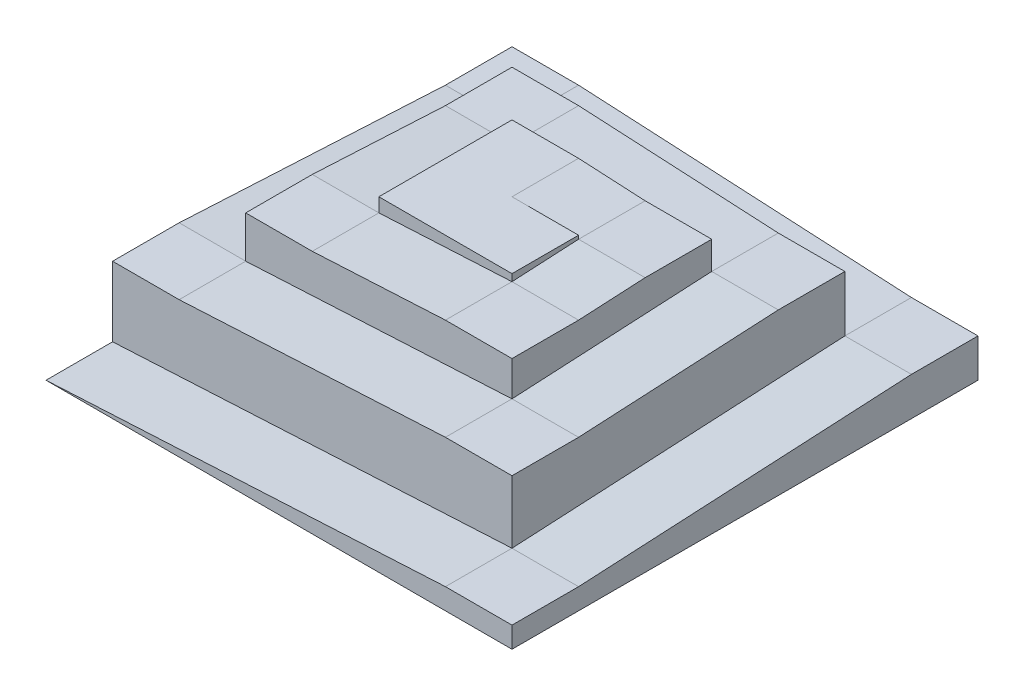
ISO-10303-21;
HEADER;
FILE_DESCRIPTION(('STEP AP214'),'2;1');
FILE_NAME('part.step','',(''),(''),'','','');
FILE_SCHEMA(('AUTOMOTIVE_DESIGN { 1 0 10303 214 1 1 1 1 }'));
ENDSEC;
DATA;
#1=APPLICATION_CONTEXT('core data for automotive mechanical design processes');
#2=APPLICATION_PROTOCOL_DEFINITION('international standard','automotive_design',2000,#1);
#3=PRODUCT_CONTEXT('',#1,'mechanical');
#4=PRODUCT('Part','Part','',(#3));
#5=PRODUCT_RELATED_PRODUCT_CATEGORY('part','',(#4));
#6=PRODUCT_DEFINITION_FORMATION('','',#4);
#7=PRODUCT_DEFINITION_CONTEXT('part definition',#1,'design');
#8=PRODUCT_DEFINITION('design','',#6,#7);
#9=PRODUCT_DEFINITION_SHAPE('','',#8);
#10=(LENGTH_UNIT() NAMED_UNIT(*) SI_UNIT(.MILLI.,.METRE.));
#11=(NAMED_UNIT(*) PLANE_ANGLE_UNIT() SI_UNIT($,.RADIAN.));
#12=(NAMED_UNIT(*) SI_UNIT($,.STERADIAN.) SOLID_ANGLE_UNIT());
#13=UNCERTAINTY_MEASURE_WITH_UNIT(LENGTH_MEASURE(1.E-05),#10,'distance_accuracy_value','');
#14=(GEOMETRIC_REPRESENTATION_CONTEXT(3) GLOBAL_UNCERTAINTY_ASSIGNED_CONTEXT((#13)) GLOBAL_UNIT_ASSIGNED_CONTEXT((#10,
#11,#12)) REPRESENTATION_CONTEXT('',''));
#15=CARTESIAN_POINT('',(0.,0.,0.));
#16=DIRECTION('',(0.,0.,1.));
#17=DIRECTION('',(1.,0.,0.));
#18=AXIS2_PLACEMENT_3D('',#15,#16,#17);
#19=CARTESIAN_POINT('',(133.35,5.99020917205086,19.05));
#20=DIRECTION('',(1.,0.,0.));
#21=DIRECTION('',(0.,0.,-1.));
#22=AXIS2_PLACEMENT_3D('',#19,#20,#21);
#23=PLANE('',#22);
#24=DIRECTION('',(0.,0.,-1.));
#25=VECTOR('',#24,1.);
#26=CARTESIAN_POINT('',(133.35,0.,19.05));
#27=LINE('',#26,#25);
#28=CARTESIAN_POINT('',(133.35,0.,19.05));
#29=VERTEX_POINT('',#28);
#30=CARTESIAN_POINT('',(133.35,0.,-114.3));
#31=VERTEX_POINT('',#30);
#32=EDGE_CURVE('E35',#29,#31,#27,.T.);
#33=ORIENTED_EDGE('',*,*,#32,.T.);
#34=DIRECTION('',(0.,1.,0.));
#35=VECTOR('',#34,1.);
#36=CARTESIAN_POINT('',(133.35,10.9820501487599,-114.3));
#37=LINE('',#36,#35);
#38=CARTESIAN_POINT('',(133.35,10.9820501487599,-114.3));
#39=VERTEX_POINT('',#38);
#40=EDGE_CURVE('E384',#31,#39,#37,.T.);
#41=ORIENTED_EDGE('',*,*,#40,.T.);
#42=DIRECTION('',(0.,0.,1.));
#43=VECTOR('',#42,1.);
#44=CARTESIAN_POINT('',(133.35,10.9820501487599,-95.25));
#45=LINE('',#44,#43);
#46=CARTESIAN_POINT('',(133.35,10.9820501487599,-95.25));
#47=VERTEX_POINT('',#46);
#48=EDGE_CURVE('E398',#39,#47,#45,.T.);
#49=ORIENTED_EDGE('',*,*,#48,.T.);
#50=DIRECTION('',(0.,-0.0523359562429372,0.998629534754574));
#51=VECTOR('',#50,1.);
#52=CARTESIAN_POINT('',(133.35,5.99020917205086,0.));
#53=LINE('',#52,#51);
#54=CARTESIAN_POINT('',(133.35,5.99020917205086,0.));
#55=VERTEX_POINT('',#54);
#56=EDGE_CURVE('E393',#47,#55,#53,.T.);
#57=ORIENTED_EDGE('',*,*,#56,.T.);
#58=DIRECTION('',(0.,0.,-1.));
#59=VECTOR('',#58,1.);
#60=CARTESIAN_POINT('',(133.35,5.99020917205086,19.05));
#61=LINE('',#60,#59);
#62=CARTESIAN_POINT('',(133.35,5.99020917205086,19.05));
#63=VERTEX_POINT('',#62);
#64=EDGE_CURVE('E11',#63,#55,#61,.T.);
#65=ORIENTED_EDGE('',*,*,#64,.F.);
#66=DIRECTION('',(0.,-1.,0.));
#67=VECTOR('',#66,1.);
#68=CARTESIAN_POINT('',(133.35,5.99020917205086,19.05));
#69=LINE('',#68,#67);
#70=EDGE_CURVE('E409',#63,#29,#69,.T.);
#71=ORIENTED_EDGE('',*,*,#70,.T.);
#72=EDGE_LOOP('',(#33,#41,#49,#57,#65,#71));
#73=FACE_BOUND('',#72,.T.);
#74=ADVANCED_FACE('F32',(#73),#23,.T.);
#75=CARTESIAN_POINT('',(114.3,5.99020917205086,19.05));
#76=DIRECTION('',(0.,1.,0.));
#77=DIRECTION('',(-1.,0.,0.));
#78=AXIS2_PLACEMENT_3D('',#75,#76,#77);
#79=PLANE('',#78);
#80=DIRECTION('',(1.,0.,0.));
#81=VECTOR('',#80,1.);
#82=CARTESIAN_POINT('',(114.3,5.99020917205086,0.));
#83=LINE('',#82,#81);
#84=CARTESIAN_POINT('',(114.3,5.99020917205086,0.));
#85=VERTEX_POINT('',#84);
#86=EDGE_CURVE('E412',#85,#55,#83,.T.);
#87=ORIENTED_EDGE('',*,*,#86,.F.);
#88=DIRECTION('',(0.,0.,-1.));
#89=VECTOR('',#88,1.);
#90=CARTESIAN_POINT('',(114.3,5.99020917205086,19.05));
#91=LINE('',#90,#89);
#92=CARTESIAN_POINT('',(114.3,5.99020917205086,19.05));
#93=VERTEX_POINT('',#92);
#94=EDGE_CURVE('E40',#93,#85,#91,.T.);
#95=ORIENTED_EDGE('',*,*,#94,.F.);
#96=DIRECTION('',(1.,0.,0.));
#97=VECTOR('',#96,1.);
#98=CARTESIAN_POINT('',(114.3,5.99020917205086,19.05));
#99=LINE('',#98,#97);
#100=EDGE_CURVE('E417',#93,#63,#99,.T.);
#101=ORIENTED_EDGE('',*,*,#100,.T.);
#102=ORIENTED_EDGE('',*,*,#64,.T.);
#103=EDGE_LOOP('',(#87,#95,#101,#102));
#104=FACE_BOUND('',#103,.T.);
#105=ADVANCED_FACE('F441',(#104),#79,.T.);
#106=CARTESIAN_POINT('',(0.,0.,19.05));
#107=DIRECTION('',(-0.0523359562429373,0.998629534754574,0.));
#108=DIRECTION('',(-0.998629534754574,-0.0523359562429373,0.));
#109=AXIS2_PLACEMENT_3D('',#106,#107,#108);
#110=PLANE('',#109);
#111=DIRECTION('',(0.998629534754574,0.0523359562429373,0.));
#112=VECTOR('',#111,1.);
#113=CARTESIAN_POINT('',(0.,0.,0.));
#114=LINE('',#113,#112);
#115=CARTESIAN_POINT('',(0.,0.,0.));
#116=VERTEX_POINT('',#115);
#117=EDGE_CURVE('E404',#116,#85,#114,.T.);
#118=ORIENTED_EDGE('',*,*,#117,.F.);
#119=DIRECTION('',(0.,0.,-1.));
#120=VECTOR('',#119,1.);
#121=CARTESIAN_POINT('',(0.,0.,19.05));
#122=LINE('',#121,#120);
#123=CARTESIAN_POINT('',(0.,0.,19.05));
#124=VERTEX_POINT('',#123);
#125=EDGE_CURVE('E422',#124,#116,#122,.T.);
#126=ORIENTED_EDGE('',*,*,#125,.F.);
#127=DIRECTION('',(0.998629534754574,0.0523359562429373,0.));
#128=VECTOR('',#127,1.);
#129=CARTESIAN_POINT('',(0.,0.,19.05));
#130=LINE('',#129,#128);
#131=EDGE_CURVE('E415',#124,#93,#130,.T.);
#132=ORIENTED_EDGE('',*,*,#131,.T.);
#133=ORIENTED_EDGE('',*,*,#94,.T.);
#134=EDGE_LOOP('',(#118,#126,#132,#133));
#135=FACE_BOUND('',#134,.T.);
#136=ADVANCED_FACE('F448',(#135),#110,.T.);
#137=CARTESIAN_POINT('',(133.35,0.,19.05));
#138=DIRECTION('',(0.,-1.,0.));
#139=DIRECTION('',(0.,0.,-1.));
#140=AXIS2_PLACEMENT_3D('',#137,#138,#139);
#141=PLANE('',#140);
#142=ORIENTED_EDGE('',*,*,#125,.T.);
#143=DIRECTION('',(0.,0.,-1.));
#144=VECTOR('',#143,1.);
#145=CARTESIAN_POINT('',(0.,0.,-95.25));
#146=LINE('',#145,#144);
#147=CARTESIAN_POINT('',(0.,0.,-114.3));
#148=VERTEX_POINT('',#147);
#149=EDGE_CURVE('E375',#116,#148,#146,.T.);
#150=ORIENTED_EDGE('',*,*,#149,.T.);
#151=DIRECTION('',(1.,0.,0.));
#152=VECTOR('',#151,1.);
#153=CARTESIAN_POINT('',(114.3,0.,-114.3));
#154=LINE('',#153,#152);
#155=EDGE_CURVE('E395',#148,#31,#154,.T.);
#156=ORIENTED_EDGE('',*,*,#155,.T.);
#157=ORIENTED_EDGE('',*,*,#32,.F.);
#158=DIRECTION('',(-1.,0.,0.));
#159=VECTOR('',#158,1.);
#160=CARTESIAN_POINT('',(133.35,0.,19.05));
#161=LINE('',#160,#159);
#162=EDGE_CURVE('E411',#29,#124,#161,.T.);
#163=ORIENTED_EDGE('',*,*,#162,.T.);
#164=EDGE_LOOP('',(#142,#150,#156,#157,#163));
#165=FACE_BOUND('',#164,.T.);
#166=ADVANCED_FACE('F428',(#165),#141,.T.);
#167=CARTESIAN_POINT('',(0.,0.,19.05));
#168=DIRECTION('',(0.,0.,-1.));
#169=DIRECTION('',(-1.,0.,0.));
#170=AXIS2_PLACEMENT_3D('',#167,#168,#169);
#171=PLANE('',#170);
#172=ORIENTED_EDGE('',*,*,#70,.F.);
#173=ORIENTED_EDGE('',*,*,#100,.F.);
#174=ORIENTED_EDGE('',*,*,#131,.F.);
#175=ORIENTED_EDGE('',*,*,#162,.F.);
#176=EDGE_LOOP('',(#172,#173,#174,#175));
#177=FACE_BOUND('',#176,.T.);
#178=ADVANCED_FACE('F445',(#177),#171,.F.);
#179=CARTESIAN_POINT('',(114.3,5.99020917205086,0.));
#180=DIRECTION('',(0.,0.998629534754574,0.0523359562429372));
#181=DIRECTION('',(0.,-0.0523359562429373,0.998629534754574));
#182=AXIS2_PLACEMENT_3D('',#179,#180,#181);
#183=PLANE('',#182);
#184=ORIENTED_EDGE('',*,*,#56,.F.);
#185=DIRECTION('',(1.,0.,0.));
#186=VECTOR('',#185,1.);
#187=CARTESIAN_POINT('',(114.3,10.9820501487599,-95.25));
#188=LINE('',#187,#186);
#189=CARTESIAN_POINT('',(114.3,10.9820501487599,-95.25));
#190=VERTEX_POINT('',#189);
#191=EDGE_CURVE('E402',#190,#47,#188,.T.);
#192=ORIENTED_EDGE('',*,*,#191,.F.);
#193=DIRECTION('',(0.,-0.0523359562429372,0.998629534754574));
#194=VECTOR('',#193,1.);
#195=CARTESIAN_POINT('',(114.3,5.99020917205086,0.));
#196=LINE('',#195,#194);
#197=EDGE_CURVE('E392',#190,#85,#196,.T.);
#198=ORIENTED_EDGE('',*,*,#197,.T.);
#199=ORIENTED_EDGE('',*,*,#86,.T.);
#200=EDGE_LOOP('',(#184,#192,#198,#199));
#201=FACE_BOUND('',#200,.T.);
#202=ADVANCED_FACE('F578',(#201),#183,.T.);
#203=CARTESIAN_POINT('',(114.3,10.9820501487599,-95.25));
#204=DIRECTION('',(0.,1.,0.));
#205=DIRECTION('',(0.,0.,1.));
#206=AXIS2_PLACEMENT_3D('',#203,#204,#205);
#207=PLANE('',#206);
#208=ORIENTED_EDGE('',*,*,#48,.F.);
#209=DIRECTION('',(1.,0.,0.));
#210=VECTOR('',#209,1.);
#211=CARTESIAN_POINT('',(114.3,10.9820501487599,-114.3));
#212=LINE('',#211,#210);
#213=CARTESIAN_POINT('',(114.3,10.9820501487599,-114.3));
#214=VERTEX_POINT('',#213);
#215=EDGE_CURVE('E405',#214,#39,#212,.T.);
#216=ORIENTED_EDGE('',*,*,#215,.F.);
#217=DIRECTION('',(0.,0.,1.));
#218=VECTOR('',#217,1.);
#219=CARTESIAN_POINT('',(114.3,10.9820501487599,-95.25));
#220=LINE('',#219,#218);
#221=EDGE_CURVE('E389',#214,#190,#220,.T.);
#222=ORIENTED_EDGE('',*,*,#221,.T.);
#223=ORIENTED_EDGE('',*,*,#191,.T.);
#224=EDGE_LOOP('',(#208,#216,#222,#223));
#225=FACE_BOUND('',#224,.T.);
#226=ADVANCED_FACE('F437',(#225),#207,.T.);
#227=CARTESIAN_POINT('',(114.3,10.9820501487599,-114.3));
#228=DIRECTION('',(0.,0.,-1.));
#229=DIRECTION('',(-1.,0.,0.));
#230=AXIS2_PLACEMENT_3D('',#227,#228,#229);
#231=PLANE('',#230);
#232=ORIENTED_EDGE('',*,*,#40,.F.);
#233=ORIENTED_EDGE('',*,*,#155,.F.);
#234=DIRECTION('',(0.,1.,0.));
#235=VECTOR('',#234,1.);
#236=CARTESIAN_POINT('',(0.,15.9738911254689,-114.3));
#237=LINE('',#236,#235);
#238=CARTESIAN_POINT('',(0.,15.9738911254689,-114.3));
#239=VERTEX_POINT('',#238);
#240=EDGE_CURVE('E367',#148,#239,#237,.T.);
#241=ORIENTED_EDGE('',*,*,#240,.T.);
#242=DIRECTION('',(1.,0.,0.));
#243=VECTOR('',#242,1.);
#244=CARTESIAN_POINT('',(19.05,15.9738911254689,-114.3));
#245=LINE('',#244,#243);
#246=CARTESIAN_POINT('',(19.05,15.9738911254689,-114.3));
#247=VERTEX_POINT('',#246);
#248=EDGE_CURVE('E378',#239,#247,#245,.T.);
#249=ORIENTED_EDGE('',*,*,#248,.T.);
#250=DIRECTION('',(0.998629534754574,-0.0523359562429373,0.));
#251=VECTOR('',#250,1.);
#252=CARTESIAN_POINT('',(114.3,10.9820501487599,-114.3));
#253=LINE('',#252,#251);
#254=EDGE_CURVE('E373',#247,#214,#253,.T.);
#255=ORIENTED_EDGE('',*,*,#254,.T.);
#256=ORIENTED_EDGE('',*,*,#215,.T.);
#257=EDGE_LOOP('',(#232,#233,#241,#249,#255,#256));
#258=FACE_BOUND('',#257,.T.);
#259=ADVANCED_FACE('F431',(#258),#231,.T.);
#260=CARTESIAN_POINT('',(114.3,10.9820501487599,-95.25));
#261=DIRECTION('',(0.0523359562429373,0.998629534754574,0.));
#262=DIRECTION('',(-0.998629534754574,0.0523359562429373,0.));
#263=AXIS2_PLACEMENT_3D('',#260,#261,#262);
#264=PLANE('',#263);
#265=ORIENTED_EDGE('',*,*,#254,.F.);
#266=DIRECTION('',(0.,0.,-1.));
#267=VECTOR('',#266,1.);
#268=CARTESIAN_POINT('',(19.05,15.9738911254689,-95.25));
#269=LINE('',#268,#267);
#270=CARTESIAN_POINT('',(19.05,15.9738911254689,-95.25));
#271=VERTEX_POINT('',#270);
#272=EDGE_CURVE('E382',#271,#247,#269,.T.);
#273=ORIENTED_EDGE('',*,*,#272,.F.);
#274=DIRECTION('',(0.998629534754574,-0.0523359562429373,0.));
#275=VECTOR('',#274,1.);
#276=CARTESIAN_POINT('',(114.3,10.9820501487599,-95.25));
#277=LINE('',#276,#275);
#278=EDGE_CURVE('E372',#271,#190,#277,.T.);
#279=ORIENTED_EDGE('',*,*,#278,.T.);
#280=ORIENTED_EDGE('',*,*,#221,.F.);
#281=EDGE_LOOP('',(#265,#273,#279,#280));
#282=FACE_BOUND('',#281,.T.);
#283=ADVANCED_FACE('F484',(#282),#264,.T.);
#284=CARTESIAN_POINT('',(19.05,15.9738911254689,-95.25));
#285=DIRECTION('',(0.,1.,0.));
#286=DIRECTION('',(0.,0.,1.));
#287=AXIS2_PLACEMENT_3D('',#284,#285,#286);
#288=PLANE('',#287);
#289=ORIENTED_EDGE('',*,*,#248,.F.);
#290=DIRECTION('',(0.,0.,-1.));
#291=VECTOR('',#290,1.);
#292=CARTESIAN_POINT('',(0.,15.9738911254689,-95.25));
#293=LINE('',#292,#291);
#294=CARTESIAN_POINT('',(0.,15.9738911254689,-95.25));
#295=VERTEX_POINT('',#294);
#296=EDGE_CURVE('E385',#295,#239,#293,.T.);
#297=ORIENTED_EDGE('',*,*,#296,.F.);
#298=DIRECTION('',(1.,0.,0.));
#299=VECTOR('',#298,1.);
#300=CARTESIAN_POINT('',(19.05,15.9738911254689,-95.25));
#301=LINE('',#300,#299);
#302=EDGE_CURVE('E369',#295,#271,#301,.T.);
#303=ORIENTED_EDGE('',*,*,#302,.T.);
#304=ORIENTED_EDGE('',*,*,#272,.T.);
#305=EDGE_LOOP('',(#289,#297,#303,#304));
#306=FACE_BOUND('',#305,.T.);
#307=ADVANCED_FACE('F480',(#306),#288,.T.);
#308=CARTESIAN_POINT('',(0.,15.9738911254689,-95.25));
#309=DIRECTION('',(-1.,0.,0.));
#310=DIRECTION('',(0.,0.,1.));
#311=AXIS2_PLACEMENT_3D('',#308,#309,#310);
#312=PLANE('',#311);
#313=ORIENTED_EDGE('',*,*,#240,.F.);
#314=ORIENTED_EDGE('',*,*,#149,.F.);
#315=DIRECTION('',(0.,1.,0.));
#316=VECTOR('',#315,1.);
#317=CARTESIAN_POINT('',(0.,19.9673639068361,0.));
#318=LINE('',#317,#316);
#319=CARTESIAN_POINT('',(0.,19.9673639068361,0.));
#320=VERTEX_POINT('',#319);
#321=EDGE_CURVE('E350',#116,#320,#318,.T.);
#322=ORIENTED_EDGE('',*,*,#321,.T.);
#323=DIRECTION('',(0.,0.,-1.));
#324=VECTOR('',#323,1.);
#325=CARTESIAN_POINT('',(0.,19.9673639068361,-19.05));
#326=LINE('',#325,#324);
#327=CARTESIAN_POINT('',(0.,19.9673639068361,-19.05));
#328=VERTEX_POINT('',#327);
#329=EDGE_CURVE('E361',#320,#328,#326,.T.);
#330=ORIENTED_EDGE('',*,*,#329,.T.);
#331=DIRECTION('',(0.,-0.0523359562429358,-0.998629534754574));
#332=VECTOR('',#331,1.);
#333=CARTESIAN_POINT('',(0.,15.9738911254689,-95.25));
#334=LINE('',#333,#332);
#335=EDGE_CURVE('E356',#328,#295,#334,.T.);
#336=ORIENTED_EDGE('',*,*,#335,.T.);
#337=ORIENTED_EDGE('',*,*,#296,.T.);
#338=EDGE_LOOP('',(#313,#314,#322,#330,#336,#337));
#339=FACE_BOUND('',#338,.T.);
#340=ADVANCED_FACE('F476',(#339),#312,.T.);
#341=CARTESIAN_POINT('',(19.05,15.9738911254689,-95.25));
#342=DIRECTION('',(0.,0.998629534754574,-0.0523359562429358));
#343=DIRECTION('',(0.,0.0523359562429358,0.998629534754574));
#344=AXIS2_PLACEMENT_3D('',#341,#342,#343);
#345=PLANE('',#344);
#346=ORIENTED_EDGE('',*,*,#335,.F.);
#347=DIRECTION('',(-1.,0.,0.));
#348=VECTOR('',#347,1.);
#349=CARTESIAN_POINT('',(19.05,19.9673639068361,-19.05));
#350=LINE('',#349,#348);
#351=CARTESIAN_POINT('',(19.05,19.9673639068361,-19.05));
#352=VERTEX_POINT('',#351);
#353=EDGE_CURVE('E365',#352,#328,#350,.T.);
#354=ORIENTED_EDGE('',*,*,#353,.F.);
#355=DIRECTION('',(0.,-0.0523359562429358,-0.998629534754574));
#356=VECTOR('',#355,1.);
#357=CARTESIAN_POINT('',(19.05,15.9738911254689,-95.25));
#358=LINE('',#357,#356);
#359=EDGE_CURVE('E355',#352,#271,#358,.T.);
#360=ORIENTED_EDGE('',*,*,#359,.T.);
#361=ORIENTED_EDGE('',*,*,#302,.F.);
#362=EDGE_LOOP('',(#346,#354,#360,#361));
#363=FACE_BOUND('',#362,.T.);
#364=ADVANCED_FACE('F602',(#363),#345,.T.);
#365=CARTESIAN_POINT('',(19.05,19.9673639068361,-19.05));
#366=DIRECTION('',(0.,1.,0.));
#367=DIRECTION('',(0.,0.,1.));
#368=AXIS2_PLACEMENT_3D('',#365,#366,#367);
#369=PLANE('',#368);
#370=ORIENTED_EDGE('',*,*,#329,.F.);
#371=DIRECTION('',(-1.,0.,0.));
#372=VECTOR('',#371,1.);
#373=CARTESIAN_POINT('',(19.05,19.9673639068361,0.));
#374=LINE('',#373,#372);
#375=CARTESIAN_POINT('',(19.05,19.9673639068361,0.));
#376=VERTEX_POINT('',#375);
#377=EDGE_CURVE('E358',#376,#320,#374,.T.);
#378=ORIENTED_EDGE('',*,*,#377,.F.);
#379=DIRECTION('',(0.,0.,-1.));
#380=VECTOR('',#379,1.);
#381=CARTESIAN_POINT('',(19.05,19.9673639068361,-19.05));
#382=LINE('',#381,#380);
#383=EDGE_CURVE('E352',#376,#352,#382,.T.);
#384=ORIENTED_EDGE('',*,*,#383,.T.);
#385=ORIENTED_EDGE('',*,*,#353,.T.);
#386=EDGE_LOOP('',(#370,#378,#384,#385));
#387=FACE_BOUND('',#386,.T.);
#388=ADVANCED_FACE('F472',(#387),#369,.T.);
#389=CARTESIAN_POINT('',(19.05,19.9673639068361,0.));
#390=DIRECTION('',(0.,0.,1.));
#391=DIRECTION('',(1.,0.,0.));
#392=AXIS2_PLACEMENT_3D('',#389,#390,#391);
#393=PLANE('',#392);
#394=ORIENTED_EDGE('',*,*,#321,.F.);
#395=ORIENTED_EDGE('',*,*,#117,.T.);
#396=DIRECTION('',(0.,1.,0.));
#397=VECTOR('',#396,1.);
#398=CARTESIAN_POINT('',(114.3,0.,0.));
#399=LINE('',#398,#397);
#400=CARTESIAN_POINT('',(114.3,23.9608366882033,0.));
#401=VERTEX_POINT('',#400);
#402=EDGE_CURVE('E339',#85,#401,#399,.T.);
#403=ORIENTED_EDGE('',*,*,#402,.T.);
#404=DIRECTION('',(-1.,0.,0.));
#405=VECTOR('',#404,1.);
#406=CARTESIAN_POINT('',(114.3,23.9608366882033,0.));
#407=LINE('',#406,#405);
#408=CARTESIAN_POINT('',(95.25,23.9608366882033,0.));
#409=VERTEX_POINT('',#408);
#410=EDGE_CURVE('E332',#401,#409,#407,.T.);
#411=ORIENTED_EDGE('',*,*,#410,.T.);
#412=DIRECTION('',(-0.998629534754574,-0.0523359562429372,0.));
#413=VECTOR('',#412,1.);
#414=CARTESIAN_POINT('',(95.25,23.9608366882033,0.));
#415=LINE('',#414,#413);
#416=EDGE_CURVE('E344',#409,#376,#415,.T.);
#417=ORIENTED_EDGE('',*,*,#416,.T.);
#418=ORIENTED_EDGE('',*,*,#377,.T.);
#419=EDGE_LOOP('',(#394,#395,#403,#411,#417,#418));
#420=FACE_BOUND('',#419,.T.);
#421=ADVANCED_FACE('F451',(#420),#393,.T.);
#422=CARTESIAN_POINT('',(114.3,23.9608366882033,-19.05));
#423=DIRECTION('',(0.,1.,0.));
#424=DIRECTION('',(-1.,0.,0.));
#425=AXIS2_PLACEMENT_3D('',#422,#423,#424);
#426=PLANE('',#425);
#427=ORIENTED_EDGE('',*,*,#410,.F.);
#428=DIRECTION('',(0.,0.,1.));
#429=VECTOR('',#428,1.);
#430=CARTESIAN_POINT('',(114.3,23.9608366882033,-19.05));
#431=LINE('',#430,#429);
#432=CARTESIAN_POINT('',(114.3,23.9608366882033,-19.05));
#433=VERTEX_POINT('',#432);
#434=EDGE_CURVE('E347',#433,#401,#431,.T.);
#435=ORIENTED_EDGE('',*,*,#434,.F.);
#436=DIRECTION('',(-1.,0.,0.));
#437=VECTOR('',#436,1.);
#438=CARTESIAN_POINT('',(114.3,23.9608366882033,-19.05));
#439=LINE('',#438,#437);
#440=CARTESIAN_POINT('',(95.25,23.9608366882034,-19.05));
#441=VERTEX_POINT('',#440);
#442=EDGE_CURVE('E335',#433,#441,#439,.T.);
#443=ORIENTED_EDGE('',*,*,#442,.T.);
#444=DIRECTION('',(0.,0.,1.));
#445=VECTOR('',#444,1.);
#446=CARTESIAN_POINT('',(95.25,23.9608366882033,-19.05));
#447=LINE('',#446,#445);
#448=EDGE_CURVE('E341',#441,#409,#447,.T.);
#449=ORIENTED_EDGE('',*,*,#448,.T.);
#450=EDGE_LOOP('',(#427,#435,#443,#449));
#451=FACE_BOUND('',#450,.T.);
#452=ADVANCED_FACE('F461',(#451),#426,.T.);
#453=CARTESIAN_POINT('',(114.3,0.,-19.05));
#454=DIRECTION('',(1.,0.,0.));
#455=DIRECTION('',(0.,0.,-1.));
#456=AXIS2_PLACEMENT_3D('',#453,#454,#455);
#457=PLANE('',#456);
#458=ORIENTED_EDGE('',*,*,#402,.F.);
#459=ORIENTED_EDGE('',*,*,#197,.F.);
#460=DIRECTION('',(0.,1.,0.));
#461=VECTOR('',#460,1.);
#462=CARTESIAN_POINT('',(114.3,26.9559412742289,-95.25));
#463=LINE('',#462,#461);
#464=CARTESIAN_POINT('',(114.3,26.9559412742289,-95.25));
#465=VERTEX_POINT('',#464);
#466=EDGE_CURVE('E315',#190,#465,#463,.T.);
#467=ORIENTED_EDGE('',*,*,#466,.T.);
#468=DIRECTION('',(0.,0.,1.));
#469=VECTOR('',#468,1.);
#470=CARTESIAN_POINT('',(114.3,26.9559412742289,-76.2));
#471=LINE('',#470,#469);
#472=CARTESIAN_POINT('',(114.3,26.9559412742289,-76.2));
#473=VERTEX_POINT('',#472);
#474=EDGE_CURVE('E326',#465,#473,#471,.T.);
#475=ORIENTED_EDGE('',*,*,#474,.T.);
#476=DIRECTION('',(0.,-0.0523359562429375,0.998629534754574));
#477=VECTOR('',#476,1.);
#478=CARTESIAN_POINT('',(114.3,23.9608366882034,-19.05));
#479=LINE('',#478,#477);
#480=EDGE_CURVE('E322',#473,#433,#479,.T.);
#481=ORIENTED_EDGE('',*,*,#480,.T.);
#482=ORIENTED_EDGE('',*,*,#434,.T.);
#483=EDGE_LOOP('',(#458,#459,#467,#475,#481,#482));
#484=FACE_BOUND('',#483,.T.);
#485=ADVANCED_FACE('F454',(#484),#457,.T.);
#486=CARTESIAN_POINT('',(95.25,23.9608366882033,-19.05));
#487=DIRECTION('',(-0.0523359562429371,0.998629534754574,0.));
#488=DIRECTION('',(-0.998629534754574,-0.0523359562429372,0.));
#489=AXIS2_PLACEMENT_3D('',#486,#487,#488);
#490=PLANE('',#489);
#491=ORIENTED_EDGE('',*,*,#416,.F.);
#492=ORIENTED_EDGE('',*,*,#448,.F.);
#493=DIRECTION('',(-0.998629534754574,-0.0523359562429372,0.));
#494=VECTOR('',#493,1.);
#495=CARTESIAN_POINT('',(95.25,23.9608366882033,-19.05));
#496=LINE('',#495,#494);
#497=EDGE_CURVE('E338',#441,#352,#496,.T.);
#498=ORIENTED_EDGE('',*,*,#497,.T.);
#499=ORIENTED_EDGE('',*,*,#383,.F.);
#500=EDGE_LOOP('',(#491,#492,#498,#499));
#501=FACE_BOUND('',#500,.T.);
#502=ADVANCED_FACE('F468',(#501),#490,.T.);
#503=CARTESIAN_POINT('',(95.25,23.9608366882034,-19.05));
#504=DIRECTION('',(0.,0.998629534754574,0.0523359562429375));
#505=DIRECTION('',(0.,-0.0523359562429375,0.998629534754574));
#506=AXIS2_PLACEMENT_3D('',#503,#504,#505);
#507=PLANE('',#506);
#508=ORIENTED_EDGE('',*,*,#480,.F.);
#509=DIRECTION('',(1.,0.,0.));
#510=VECTOR('',#509,1.);
#511=CARTESIAN_POINT('',(95.25,26.9559412742289,-76.2));
#512=LINE('',#511,#510);
#513=CARTESIAN_POINT('',(95.25,26.9559412742289,-76.2));
#514=VERTEX_POINT('',#513);
#515=EDGE_CURVE('E330',#514,#473,#512,.T.);
#516=ORIENTED_EDGE('',*,*,#515,.F.);
#517=DIRECTION('',(0.,-0.0523359562429375,0.998629534754574));
#518=VECTOR('',#517,1.);
#519=CARTESIAN_POINT('',(95.25,23.9608366882034,-19.05));
#520=LINE('',#519,#518);
#521=EDGE_CURVE('E321',#514,#441,#520,.T.);
#522=ORIENTED_EDGE('',*,*,#521,.T.);
#523=ORIENTED_EDGE('',*,*,#442,.F.);
#524=EDGE_LOOP('',(#508,#516,#522,#523));
#525=FACE_BOUND('',#524,.T.);
#526=ADVANCED_FACE('F510',(#525),#507,.T.);
#527=CARTESIAN_POINT('',(95.25,26.9559412742289,-76.2));
#528=DIRECTION('',(0.,1.,0.));
#529=DIRECTION('',(0.,0.,1.));
#530=AXIS2_PLACEMENT_3D('',#527,#528,#529);
#531=PLANE('',#530);
#532=ORIENTED_EDGE('',*,*,#474,.F.);
#533=DIRECTION('',(1.,0.,0.));
#534=VECTOR('',#533,1.);
#535=CARTESIAN_POINT('',(95.25,26.9559412742289,-95.25));
#536=LINE('',#535,#534);
#537=CARTESIAN_POINT('',(95.25,26.9559412742289,-95.25));
#538=VERTEX_POINT('',#537);
#539=EDGE_CURVE('E324',#538,#465,#536,.T.);
#540=ORIENTED_EDGE('',*,*,#539,.F.);
#541=DIRECTION('',(0.,0.,1.));
#542=VECTOR('',#541,1.);
#543=CARTESIAN_POINT('',(95.25,26.9559412742289,-76.2));
#544=LINE('',#543,#542);
#545=EDGE_CURVE('E318',#538,#514,#544,.T.);
#546=ORIENTED_EDGE('',*,*,#545,.T.);
#547=ORIENTED_EDGE('',*,*,#515,.T.);
#548=EDGE_LOOP('',(#532,#540,#546,#547));
#549=FACE_BOUND('',#548,.T.);
#550=ADVANCED_FACE('F507',(#549),#531,.T.);
#551=CARTESIAN_POINT('',(95.25,26.9559412742289,-95.25));
#552=DIRECTION('',(0.,0.,-1.));
#553=DIRECTION('',(-1.,0.,0.));
#554=AXIS2_PLACEMENT_3D('',#551,#552,#553);
#555=PLANE('',#554);
#556=ORIENTED_EDGE('',*,*,#466,.F.);
#557=ORIENTED_EDGE('',*,*,#278,.F.);
#558=DIRECTION('',(0.,1.,0.));
#559=VECTOR('',#558,1.);
#560=CARTESIAN_POINT('',(19.05,29.9510458602543,-95.25));
#561=LINE('',#560,#559);
#562=CARTESIAN_POINT('',(19.05,29.9510458602543,-95.25));
#563=VERTEX_POINT('',#562);
#564=EDGE_CURVE('E300',#271,#563,#561,.T.);
#565=ORIENTED_EDGE('',*,*,#564,.T.);
#566=DIRECTION('',(1.,0.,0.));
#567=VECTOR('',#566,1.);
#568=CARTESIAN_POINT('',(38.1,29.9510458602543,-95.25));
#569=LINE('',#568,#567);
#570=CARTESIAN_POINT('',(38.1,29.9510458602543,-95.25));
#571=VERTEX_POINT('',#570);
#572=EDGE_CURVE('E309',#563,#571,#569,.T.);
#573=ORIENTED_EDGE('',*,*,#572,.T.);
#574=DIRECTION('',(0.998629534754574,-0.0523359562429373,0.));
#575=VECTOR('',#574,1.);
#576=CARTESIAN_POINT('',(95.25,26.9559412742289,-95.25));
#577=LINE('',#576,#575);
#578=EDGE_CURVE('E305',#571,#538,#577,.T.);
#579=ORIENTED_EDGE('',*,*,#578,.T.);
#580=ORIENTED_EDGE('',*,*,#539,.T.);
#581=EDGE_LOOP('',(#556,#557,#565,#573,#579,#580));
#582=FACE_BOUND('',#581,.T.);
#583=ADVANCED_FACE('F488',(#582),#555,.T.);
#584=CARTESIAN_POINT('',(95.25,26.9559412742289,-76.2));
#585=DIRECTION('',(0.0523359562429373,0.998629534754574,0.));
#586=DIRECTION('',(-0.998629534754574,0.0523359562429373,0.));
#587=AXIS2_PLACEMENT_3D('',#584,#585,#586);
#588=PLANE('',#587);
#589=ORIENTED_EDGE('',*,*,#578,.F.);
#590=DIRECTION('',(0.,0.,-1.));
#591=VECTOR('',#590,1.);
#592=CARTESIAN_POINT('',(38.1,29.9510458602543,-76.2));
#593=LINE('',#592,#591);
#594=CARTESIAN_POINT('',(38.1,29.9510458602543,-76.2));
#595=VERTEX_POINT('',#594);
#596=EDGE_CURVE('E313',#595,#571,#593,.T.);
#597=ORIENTED_EDGE('',*,*,#596,.F.);
#598=DIRECTION('',(0.998629534754574,-0.0523359562429373,0.));
#599=VECTOR('',#598,1.);
#600=CARTESIAN_POINT('',(95.25,26.9559412742289,-76.2));
#601=LINE('',#600,#599);
#602=EDGE_CURVE('E304',#595,#514,#601,.T.);
#603=ORIENTED_EDGE('',*,*,#602,.T.);
#604=ORIENTED_EDGE('',*,*,#545,.F.);
#605=EDGE_LOOP('',(#589,#597,#603,#604));
#606=FACE_BOUND('',#605,.T.);
#607=ADVANCED_FACE('F502',(#606),#588,.T.);
#608=CARTESIAN_POINT('',(38.1,29.9510458602543,-76.2));
#609=DIRECTION('',(0.,1.,0.));
#610=DIRECTION('',(-1.,0.,0.));
#611=AXIS2_PLACEMENT_3D('',#608,#609,#610);
#612=PLANE('',#611);
#613=ORIENTED_EDGE('',*,*,#572,.F.);
#614=DIRECTION('',(0.,0.,-1.));
#615=VECTOR('',#614,1.);
#616=CARTESIAN_POINT('',(19.05,29.9510458602543,-76.2));
#617=LINE('',#616,#615);
#618=CARTESIAN_POINT('',(19.05,29.9510458602543,-76.2));
#619=VERTEX_POINT('',#618);
#620=EDGE_CURVE('E307',#619,#563,#617,.T.);
#621=ORIENTED_EDGE('',*,*,#620,.F.);
#622=DIRECTION('',(1.,0.,0.));
#623=VECTOR('',#622,1.);
#624=CARTESIAN_POINT('',(38.1,29.9510458602543,-76.2));
#625=LINE('',#624,#623);
#626=EDGE_CURVE('E301',#619,#595,#625,.T.);
#627=ORIENTED_EDGE('',*,*,#626,.T.);
#628=ORIENTED_EDGE('',*,*,#596,.T.);
#629=EDGE_LOOP('',(#613,#621,#627,#628));
#630=FACE_BOUND('',#629,.T.);
#631=ADVANCED_FACE('F497',(#630),#612,.T.);
#632=CARTESIAN_POINT('',(19.05,29.9510458602543,-76.2));
#633=DIRECTION('',(-1.,0.,0.));
#634=DIRECTION('',(0.,0.,1.));
#635=AXIS2_PLACEMENT_3D('',#632,#633,#634);
#636=PLANE('',#635);
#637=ORIENTED_EDGE('',*,*,#564,.F.);
#638=ORIENTED_EDGE('',*,*,#359,.F.);
#639=DIRECTION('',(0.,-1.,0.));
#640=VECTOR('',#639,1.);
#641=CARTESIAN_POINT('',(19.05,31.9477822509381,-19.05));
#642=LINE('',#641,#640);
#643=CARTESIAN_POINT('',(19.05,31.9477822509381,-19.05));
#644=VERTEX_POINT('',#643);
#645=EDGE_CURVE('E280',#644,#352,#642,.T.);
#646=ORIENTED_EDGE('',*,*,#645,.F.);
#647=DIRECTION('',(0.,0.,1.));
#648=VECTOR('',#647,1.);
#649=CARTESIAN_POINT('',(19.05,31.9477822509381,-38.1));
#650=LINE('',#649,#648);
#651=CARTESIAN_POINT('',(19.05,31.9477822509381,-38.1));
#652=VERTEX_POINT('',#651);
#653=EDGE_CURVE('E286',#652,#644,#650,.T.);
#654=ORIENTED_EDGE('',*,*,#653,.F.);
#655=DIRECTION('',(0.,0.0523359562429419,0.998629534754574));
#656=VECTOR('',#655,1.);
#657=CARTESIAN_POINT('',(19.05,29.9510458602543,-76.2));
#658=LINE('',#657,#656);
#659=EDGE_CURVE('E292',#619,#652,#658,.T.);
#660=ORIENTED_EDGE('',*,*,#659,.F.);
#661=ORIENTED_EDGE('',*,*,#620,.T.);
#662=EDGE_LOOP('',(#637,#638,#646,#654,#660,#661));
#663=FACE_BOUND('',#662,.T.);
#664=ADVANCED_FACE('F490',(#663),#636,.T.);
#665=CARTESIAN_POINT('',(38.1,31.9477822509381,-19.05));
#666=DIRECTION('',(0.,0.,-1.));
#667=DIRECTION('',(0.,1.,0.));
#668=AXIS2_PLACEMENT_3D('',#665,#666,#667);
#669=PLANE('',#668);
#670=ORIENTED_EDGE('',*,*,#645,.T.);
#671=ORIENTED_EDGE('',*,*,#497,.F.);
#672=DIRECTION('',(0.,1.,0.));
#673=VECTOR('',#672,1.);
#674=CARTESIAN_POINT('',(95.25,33.9445186416217,-19.05));
#675=LINE('',#674,#673);
#676=CARTESIAN_POINT('',(95.25,33.9445186416217,-19.05));
#677=VERTEX_POINT('',#676);
#678=EDGE_CURVE('E263',#441,#677,#675,.T.);
#679=ORIENTED_EDGE('',*,*,#678,.T.);
#680=DIRECTION('',(-1.,0.,0.));
#681=VECTOR('',#680,1.);
#682=CARTESIAN_POINT('',(76.2,33.9445186416217,-19.05));
#683=LINE('',#682,#681);
#684=CARTESIAN_POINT('',(76.2,33.9445186416217,-19.05));
#685=VERTEX_POINT('',#684);
#686=EDGE_CURVE('E273',#677,#685,#683,.T.);
#687=ORIENTED_EDGE('',*,*,#686,.T.);
#688=DIRECTION('',(-0.998629534754574,-0.0523359562429372,0.));
#689=VECTOR('',#688,1.);
#690=CARTESIAN_POINT('',(38.1,31.9477822509381,-19.05));
#691=LINE('',#690,#689);
#692=CARTESIAN_POINT('',(38.1,31.9477822509381,-19.05));
#693=VERTEX_POINT('',#692);
#694=EDGE_CURVE('E269',#685,#693,#691,.T.);
#695=ORIENTED_EDGE('',*,*,#694,.T.);
#696=DIRECTION('',(-1.,0.,0.));
#697=VECTOR('',#696,1.);
#698=CARTESIAN_POINT('',(38.1,31.9477822509381,-19.05));
#699=LINE('',#698,#697);
#700=EDGE_CURVE('E289',#693,#644,#699,.T.);
#701=ORIENTED_EDGE('',*,*,#700,.T.);
#702=EDGE_LOOP('',(#670,#671,#679,#687,#695,#701));
#703=FACE_BOUND('',#702,.T.);
#704=ADVANCED_FACE('F513',(#703),#669,.F.);
#705=CARTESIAN_POINT('',(38.1,29.9510458602543,-76.2));
#706=DIRECTION('',(0.,-0.998629534754574,0.0523359562429419));
#707=DIRECTION('',(0.,-0.0523359562429419,-0.998629534754574));
#708=AXIS2_PLACEMENT_3D('',#705,#706,#707);
#709=PLANE('',#708);
#710=ORIENTED_EDGE('',*,*,#659,.T.);
#711=DIRECTION('',(-1.,0.,0.));
#712=VECTOR('',#711,1.);
#713=CARTESIAN_POINT('',(38.1,31.9477822509381,-38.1));
#714=LINE('',#713,#712);
#715=CARTESIAN_POINT('',(38.1,31.9477822509381,-38.1));
#716=VERTEX_POINT('',#715);
#717=EDGE_CURVE('E297',#716,#652,#714,.T.);
#718=ORIENTED_EDGE('',*,*,#717,.F.);
#719=DIRECTION('',(0.,0.0523359562429419,0.998629534754574));
#720=VECTOR('',#719,1.);
#721=CARTESIAN_POINT('',(38.1,29.9510458602543,-76.2));
#722=LINE('',#721,#720);
#723=EDGE_CURVE('E283',#595,#716,#722,.T.);
#724=ORIENTED_EDGE('',*,*,#723,.F.);
#725=ORIENTED_EDGE('',*,*,#626,.F.);
#726=EDGE_LOOP('',(#710,#718,#724,#725));
#727=FACE_BOUND('',#726,.T.);
#728=ADVANCED_FACE('F533',(#727),#709,.F.);
#729=CARTESIAN_POINT('',(38.1,31.9477822509381,-38.1));
#730=DIRECTION('',(0.,-1.,0.));
#731=DIRECTION('',(0.,0.,-1.));
#732=AXIS2_PLACEMENT_3D('',#729,#730,#731);
#733=PLANE('',#732);
#734=ORIENTED_EDGE('',*,*,#653,.T.);
#735=ORIENTED_EDGE('',*,*,#700,.F.);
#736=DIRECTION('',(0.,0.,1.));
#737=VECTOR('',#736,1.);
#738=CARTESIAN_POINT('',(38.1,31.9477822509381,-38.1));
#739=LINE('',#738,#737);
#740=EDGE_CURVE('E285',#716,#693,#739,.T.);
#741=ORIENTED_EDGE('',*,*,#740,.F.);
#742=ORIENTED_EDGE('',*,*,#717,.T.);
#743=EDGE_LOOP('',(#734,#735,#741,#742));
#744=FACE_BOUND('',#743,.T.);
#745=ADVANCED_FACE('F529',(#744),#733,.F.);
#746=CARTESIAN_POINT('',(38.1,31.9477822509381,-38.1));
#747=DIRECTION('',(-0.0523359562429372,0.998629534754574,0.));
#748=DIRECTION('',(-0.998629534754574,-0.0523359562429372,0.));
#749=AXIS2_PLACEMENT_3D('',#746,#747,#748);
#750=PLANE('',#749);
#751=ORIENTED_EDGE('',*,*,#694,.F.);
#752=DIRECTION('',(0.,0.,1.));
#753=VECTOR('',#752,1.);
#754=CARTESIAN_POINT('',(76.2,33.9445186416217,-38.1));
#755=LINE('',#754,#753);
#756=CARTESIAN_POINT('',(76.2,33.9445186416217,-38.1));
#757=VERTEX_POINT('',#756);
#758=EDGE_CURVE('E278',#757,#685,#755,.T.);
#759=ORIENTED_EDGE('',*,*,#758,.F.);
#760=DIRECTION('',(-0.998629534754574,-0.0523359562429372,0.));
#761=VECTOR('',#760,1.);
#762=CARTESIAN_POINT('',(38.1,31.9477822509381,-38.1));
#763=LINE('',#762,#761);
#764=EDGE_CURVE('E212',#757,#716,#763,.T.);
#765=ORIENTED_EDGE('',*,*,#764,.T.);
#766=ORIENTED_EDGE('',*,*,#740,.T.);
#767=EDGE_LOOP('',(#751,#759,#765,#766));
#768=FACE_BOUND('',#767,.T.);
#769=ADVANCED_FACE('F526',(#768),#750,.T.);
#770=CARTESIAN_POINT('',(76.2,33.9445186416217,-38.1));
#771=DIRECTION('',(0.,1.,0.));
#772=DIRECTION('',(0.,0.,1.));
#773=AXIS2_PLACEMENT_3D('',#770,#771,#772);
#774=PLANE('',#773);
#775=ORIENTED_EDGE('',*,*,#686,.F.);
#776=DIRECTION('',(0.,0.,1.));
#777=VECTOR('',#776,1.);
#778=CARTESIAN_POINT('',(95.25,33.9445186416217,-38.1));
#779=LINE('',#778,#777);
#780=CARTESIAN_POINT('',(95.25,33.9445186416217,-38.1));
#781=VERTEX_POINT('',#780);
#782=EDGE_CURVE('E271',#781,#677,#779,.T.);
#783=ORIENTED_EDGE('',*,*,#782,.F.);
#784=DIRECTION('',(-1.,0.,0.));
#785=VECTOR('',#784,1.);
#786=CARTESIAN_POINT('',(76.2,33.9445186416217,-38.1));
#787=LINE('',#786,#785);
#788=EDGE_CURVE('E266',#781,#757,#787,.T.);
#789=ORIENTED_EDGE('',*,*,#788,.T.);
#790=ORIENTED_EDGE('',*,*,#758,.T.);
#791=EDGE_LOOP('',(#775,#783,#789,#790));
#792=FACE_BOUND('',#791,.T.);
#793=ADVANCED_FACE('F522',(#792),#774,.T.);
#794=CARTESIAN_POINT('',(95.25,33.9445186416217,-38.1));
#795=DIRECTION('',(1.,0.,0.));
#796=DIRECTION('',(0.,0.,-1.));
#797=AXIS2_PLACEMENT_3D('',#794,#795,#796);
#798=PLANE('',#797);
#799=ORIENTED_EDGE('',*,*,#678,.F.);
#800=ORIENTED_EDGE('',*,*,#521,.F.);
#801=DIRECTION('',(0.,1.,0.));
#802=VECTOR('',#801,1.);
#803=CARTESIAN_POINT('',(95.25,34.9428868369635,-76.2));
#804=LINE('',#803,#802);
#805=CARTESIAN_POINT('',(95.25,34.9428868369635,-76.2));
#806=VERTEX_POINT('',#805);
#807=EDGE_CURVE('E247',#514,#806,#804,.T.);
#808=ORIENTED_EDGE('',*,*,#807,.T.);
#809=DIRECTION('',(0.,0.,1.));
#810=VECTOR('',#809,1.);
#811=CARTESIAN_POINT('',(95.25,34.9428868369635,-57.15));
#812=LINE('',#811,#810);
#813=CARTESIAN_POINT('',(95.25,34.9428868369635,-57.15));
#814=VERTEX_POINT('',#813);
#815=EDGE_CURVE('E257',#806,#814,#812,.T.);
#816=ORIENTED_EDGE('',*,*,#815,.T.);
#817=DIRECTION('',(0.,-0.0523359562429388,0.998629534754574));
#818=VECTOR('',#817,1.);
#819=CARTESIAN_POINT('',(95.25,33.9445186416217,-38.1));
#820=LINE('',#819,#818);
#821=EDGE_CURVE('E253',#814,#781,#820,.T.);
#822=ORIENTED_EDGE('',*,*,#821,.T.);
#823=ORIENTED_EDGE('',*,*,#782,.T.);
#824=EDGE_LOOP('',(#799,#800,#808,#816,#822,#823));
#825=FACE_BOUND('',#824,.T.);
#826=ADVANCED_FACE('F515',(#825),#798,.T.);
#827=CARTESIAN_POINT('',(76.2,33.9445186416217,-38.1));
#828=DIRECTION('',(0.,0.998629534754574,0.0523359562429388));
#829=DIRECTION('',(0.,-0.0523359562429388,0.998629534754574));
#830=AXIS2_PLACEMENT_3D('',#827,#828,#829);
#831=PLANE('',#830);
#832=ORIENTED_EDGE('',*,*,#821,.F.);
#833=DIRECTION('',(1.,0.,0.));
#834=VECTOR('',#833,1.);
#835=CARTESIAN_POINT('',(76.2,34.9428868369635,-57.15));
#836=LINE('',#835,#834);
#837=CARTESIAN_POINT('',(76.2,34.9428868369635,-57.15));
#838=VERTEX_POINT('',#837);
#839=EDGE_CURVE('E261',#838,#814,#836,.T.);
#840=ORIENTED_EDGE('',*,*,#839,.F.);
#841=DIRECTION('',(0.,-0.0523359562429388,0.998629534754574));
#842=VECTOR('',#841,1.);
#843=CARTESIAN_POINT('',(76.2,33.9445186416217,-38.1));
#844=LINE('',#843,#842);
#845=EDGE_CURVE('E252',#838,#757,#844,.T.);
#846=ORIENTED_EDGE('',*,*,#845,.T.);
#847=ORIENTED_EDGE('',*,*,#788,.F.);
#848=EDGE_LOOP('',(#832,#840,#846,#847));
#849=FACE_BOUND('',#848,.T.);
#850=ADVANCED_FACE('F547',(#849),#831,.T.);
#851=CARTESIAN_POINT('',(76.2,34.9428868369635,-57.15));
#852=DIRECTION('',(0.,1.,0.));
#853=DIRECTION('',(0.,0.,1.));
#854=AXIS2_PLACEMENT_3D('',#851,#852,#853);
#855=PLANE('',#854);
#856=ORIENTED_EDGE('',*,*,#815,.F.);
#857=DIRECTION('',(1.,0.,0.));
#858=VECTOR('',#857,1.);
#859=CARTESIAN_POINT('',(76.2,34.9428868369635,-76.2));
#860=LINE('',#859,#858);
#861=CARTESIAN_POINT('',(76.2,34.9428868369635,-76.2));
#862=VERTEX_POINT('',#861);
#863=EDGE_CURVE('E255',#862,#806,#860,.T.);
#864=ORIENTED_EDGE('',*,*,#863,.F.);
#865=DIRECTION('',(0.,0.,1.));
#866=VECTOR('',#865,1.);
#867=CARTESIAN_POINT('',(76.2,34.9428868369635,-57.15));
#868=LINE('',#867,#866);
#869=EDGE_CURVE('E249',#862,#838,#868,.T.);
#870=ORIENTED_EDGE('',*,*,#869,.T.);
#871=ORIENTED_EDGE('',*,*,#839,.T.);
#872=EDGE_LOOP('',(#856,#864,#870,#871));
#873=FACE_BOUND('',#872,.T.);
#874=ADVANCED_FACE('F543',(#873),#855,.T.);
#875=CARTESIAN_POINT('',(76.2,34.9428868369635,-76.2));
#876=DIRECTION('',(0.,0.,-1.));
#877=DIRECTION('',(-1.,0.,0.));
#878=AXIS2_PLACEMENT_3D('',#875,#876,#877);
#879=PLANE('',#878);
#880=ORIENTED_EDGE('',*,*,#807,.F.);
#881=ORIENTED_EDGE('',*,*,#602,.F.);
#882=DIRECTION('',(0.,1.,0.));
#883=VECTOR('',#882,1.);
#884=CARTESIAN_POINT('',(38.1,35.9412550323053,-76.2));
#885=LINE('',#884,#883);
#886=CARTESIAN_POINT('',(38.1,35.9412550323053,-76.2));
#887=VERTEX_POINT('',#886);
#888=EDGE_CURVE('E224',#595,#887,#885,.T.);
#889=ORIENTED_EDGE('',*,*,#888,.T.);
#890=DIRECTION('',(1.,0.,0.));
#891=VECTOR('',#890,1.);
#892=CARTESIAN_POINT('',(57.15,35.9412550323053,-76.2));
#893=LINE('',#892,#891);
#894=CARTESIAN_POINT('',(57.15,35.9412550323053,-76.2));
#895=VERTEX_POINT('',#894);
#896=EDGE_CURVE('E241',#887,#895,#893,.T.);
#897=ORIENTED_EDGE('',*,*,#896,.T.);
#898=DIRECTION('',(0.998629534754574,-0.0523359562429374,0.));
#899=VECTOR('',#898,1.);
#900=CARTESIAN_POINT('',(76.2,34.9428868369635,-76.2));
#901=LINE('',#900,#899);
#902=EDGE_CURVE('E239',#895,#862,#901,.T.);
#903=ORIENTED_EDGE('',*,*,#902,.T.);
#904=ORIENTED_EDGE('',*,*,#863,.T.);
#905=EDGE_LOOP('',(#880,#881,#889,#897,#903,#904));
#906=FACE_BOUND('',#905,.T.);
#907=ADVANCED_FACE('F538',(#906),#879,.T.);
#908=CARTESIAN_POINT('',(38.1,35.9412550323053,-57.15));
#909=DIRECTION('',(-1.,0.,0.));
#910=DIRECTION('',(0.,-1.,0.));
#911=AXIS2_PLACEMENT_3D('',#908,#909,#910);
#912=PLANE('',#911);
#913=ORIENTED_EDGE('',*,*,#723,.T.);
#914=DIRECTION('',(0.,-1.,0.));
#915=VECTOR('',#914,1.);
#916=CARTESIAN_POINT('',(38.1,0.,-38.1));
#917=LINE('',#916,#915);
#918=CARTESIAN_POINT('',(38.1,35.9412550323053,-38.1));
#919=VERTEX_POINT('',#918);
#920=EDGE_CURVE('E215',#919,#716,#917,.T.);
#921=ORIENTED_EDGE('',*,*,#920,.F.);
#922=DIRECTION('',(0.,0.,-1.));
#923=VECTOR('',#922,1.);
#924=CARTESIAN_POINT('',(38.1,35.9412550323053,-57.15));
#925=LINE('',#924,#923);
#926=EDGE_CURVE('E229',#919,#887,#925,.T.);
#927=ORIENTED_EDGE('',*,*,#926,.T.);
#928=ORIENTED_EDGE('',*,*,#888,.F.);
#929=EDGE_LOOP('',(#913,#921,#927,#928));
#930=FACE_BOUND('',#929,.T.);
#931=ADVANCED_FACE('F536',(#930),#912,.T.);
#932=CARTESIAN_POINT('',(76.2,34.9428868369635,-57.15));
#933=DIRECTION('',(0.0523359562429374,0.998629534754574,0.));
#934=DIRECTION('',(-0.998629534754574,0.0523359562429374,0.));
#935=AXIS2_PLACEMENT_3D('',#932,#933,#934);
#936=PLANE('',#935);
#937=ORIENTED_EDGE('',*,*,#902,.F.);
#938=DIRECTION('',(0.,0.,-1.));
#939=VECTOR('',#938,1.);
#940=CARTESIAN_POINT('',(57.15,35.9412550323053,-57.15));
#941=LINE('',#940,#939);
#942=CARTESIAN_POINT('',(57.15,35.9412550323053,-57.15));
#943=VERTEX_POINT('',#942);
#944=EDGE_CURVE('E245',#943,#895,#941,.T.);
#945=ORIENTED_EDGE('',*,*,#944,.F.);
#946=DIRECTION('',(0.998629534754574,-0.0523359562429374,0.));
#947=VECTOR('',#946,1.);
#948=CARTESIAN_POINT('',(76.2,34.9428868369635,-57.15));
#949=LINE('',#948,#947);
#950=EDGE_CURVE('E236',#943,#838,#949,.T.);
#951=ORIENTED_EDGE('',*,*,#950,.T.);
#952=ORIENTED_EDGE('',*,*,#869,.F.);
#953=EDGE_LOOP('',(#937,#945,#951,#952));
#954=FACE_BOUND('',#953,.T.);
#955=ADVANCED_FACE('F553',(#954),#936,.T.);
#956=CARTESIAN_POINT('',(57.15,35.9412550323053,-57.15));
#957=DIRECTION('',(0.,1.,0.));
#958=DIRECTION('',(0.,0.,1.));
#959=AXIS2_PLACEMENT_3D('',#956,#957,#958);
#960=PLANE('',#959);
#961=ORIENTED_EDGE('',*,*,#896,.F.);
#962=ORIENTED_EDGE('',*,*,#926,.F.);
#963=DIRECTION('',(-1.,0.,0.));
#964=VECTOR('',#963,1.);
#965=CARTESIAN_POINT('',(38.1,35.9412550323053,-38.1));
#966=LINE('',#965,#964);
#967=CARTESIAN_POINT('',(76.2,35.9412550323053,-38.1));
#968=VERTEX_POINT('',#967);
#969=EDGE_CURVE('E209',#968,#919,#966,.T.);
#970=ORIENTED_EDGE('',*,*,#969,.F.);
#971=DIRECTION('',(0.,0.,-1.));
#972=VECTOR('',#971,1.);
#973=CARTESIAN_POINT('',(76.2,35.9412550323053,-38.1));
#974=LINE('',#973,#972);
#975=CARTESIAN_POINT('',(76.2,35.9412550323053,-57.15));
#976=VERTEX_POINT('',#975);
#977=EDGE_CURVE('E218',#968,#976,#974,.T.);
#978=ORIENTED_EDGE('',*,*,#977,.T.);
#979=DIRECTION('',(-1.,0.,0.));
#980=VECTOR('',#979,1.);
#981=CARTESIAN_POINT('',(38.1,35.9412550323053,-57.15));
#982=LINE('',#981,#980);
#983=EDGE_CURVE('E234',#976,#943,#982,.T.);
#984=ORIENTED_EDGE('',*,*,#983,.T.);
#985=ORIENTED_EDGE('',*,*,#944,.T.);
#986=EDGE_LOOP('',(#961,#962,#970,#978,#984,#985));
#987=FACE_BOUND('',#986,.T.);
#988=ADVANCED_FACE('F227',(#987),#960,.T.);
#989=CARTESIAN_POINT('',(0.,0.,-57.15));
#990=DIRECTION('',(0.,0.,-1.));
#991=DIRECTION('',(-1.,0.,0.));
#992=AXIS2_PLACEMENT_3D('',#989,#990,#991);
#993=PLANE('',#992);
#994=DIRECTION('',(0.,1.,0.));
#995=VECTOR('',#994,1.);
#996=CARTESIAN_POINT('',(76.2,35.9412550323053,-57.15));
#997=LINE('',#996,#995);
#998=EDGE_CURVE('E221',#838,#976,#997,.T.);
#999=ORIENTED_EDGE('',*,*,#998,.F.);
#1000=ORIENTED_EDGE('',*,*,#950,.F.);
#1001=ORIENTED_EDGE('',*,*,#983,.F.);
#1002=EDGE_LOOP('',(#999,#1000,#1001));
#1003=FACE_BOUND('',#1002,.T.);
#1004=ADVANCED_FACE('F550',(#1003),#993,.T.);
#1005=CARTESIAN_POINT('',(76.2,35.9412550323053,-38.1));
#1006=DIRECTION('',(-1.,0.,0.));
#1007=DIRECTION('',(0.,0.,1.));
#1008=AXIS2_PLACEMENT_3D('',#1005,#1006,#1007);
#1009=PLANE('',#1008);
#1010=ORIENTED_EDGE('',*,*,#845,.F.);
#1011=ORIENTED_EDGE('',*,*,#998,.T.);
#1012=ORIENTED_EDGE('',*,*,#977,.F.);
#1013=DIRECTION('',(0.,1.,0.));
#1014=VECTOR('',#1013,1.);
#1015=CARTESIAN_POINT('',(76.2,35.9412550323053,-38.1));
#1016=LINE('',#1015,#1014);
#1017=EDGE_CURVE('E204',#757,#968,#1016,.T.);
#1018=ORIENTED_EDGE('',*,*,#1017,.F.);
#1019=EDGE_LOOP('',(#1010,#1011,#1012,#1018));
#1020=FACE_BOUND('',#1019,.T.);
#1021=ADVANCED_FACE('F219',(#1020),#1009,.F.);
#1022=CARTESIAN_POINT('',(0.,0.,-38.1));
#1023=DIRECTION('',(0.,0.,-1.));
#1024=DIRECTION('',(-1.,0.,0.));
#1025=AXIS2_PLACEMENT_3D('',#1022,#1023,#1024);
#1026=PLANE('',#1025);
#1027=ORIENTED_EDGE('',*,*,#764,.F.);
#1028=ORIENTED_EDGE('',*,*,#1017,.T.);
#1029=ORIENTED_EDGE('',*,*,#969,.T.);
#1030=ORIENTED_EDGE('',*,*,#920,.T.);
#1031=EDGE_LOOP('',(#1027,#1028,#1029,#1030));
#1032=FACE_BOUND('',#1031,.T.);
#1033=ADVANCED_FACE('F206',(#1032),#1026,.F.);
#1034=CLOSED_SHELL('',(#74,#105,#136,#166,#178,#202,#226,#259,#283,#307,#340,#364,#388,#421,
#452,#485,#502,#526,#550,#583,#607,#631,#664,#704,#728,#745,#769,#793,#826,#850,#874,#907,#931,
#955,#988,#1004,#1021,#1033));
#1035=MANIFOLD_SOLID_BREP('B2',#1034);
#1036=ADVANCED_BREP_SHAPE_REPRESENTATION('',(#18,#1035),#14);
#1037=SHAPE_DEFINITION_REPRESENTATION(#9,#1036);
ENDSEC;
END-ISO-10303-21;
